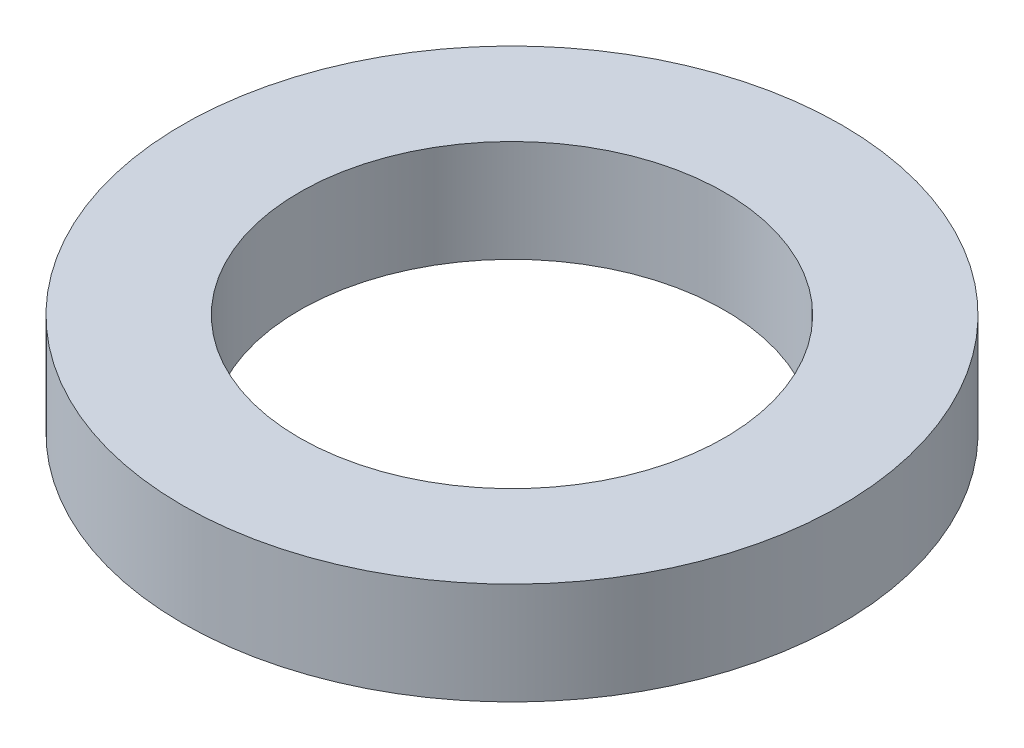
ISO-10303-21;
HEADER;
FILE_DESCRIPTION(('STEP AP214'),'2;1');
FILE_NAME('part.step','',(''),(''),'','','');
FILE_SCHEMA(('AUTOMOTIVE_DESIGN { 1 0 10303 214 1 1 1 1 }'));
ENDSEC;
DATA;
#1=APPLICATION_CONTEXT('core data for automotive mechanical design processes');
#2=APPLICATION_PROTOCOL_DEFINITION('international standard','automotive_design',2000,#1);
#3=PRODUCT_CONTEXT('',#1,'mechanical');
#4=PRODUCT('Part','Part','',(#3));
#5=PRODUCT_RELATED_PRODUCT_CATEGORY('part','',(#4));
#6=PRODUCT_DEFINITION_FORMATION('','',#4);
#7=PRODUCT_DEFINITION_CONTEXT('part definition',#1,'design');
#8=PRODUCT_DEFINITION('design','',#6,#7);
#9=PRODUCT_DEFINITION_SHAPE('','',#8);
#10=(LENGTH_UNIT() NAMED_UNIT(*) SI_UNIT(.MILLI.,.METRE.));
#11=(NAMED_UNIT(*) PLANE_ANGLE_UNIT() SI_UNIT($,.RADIAN.));
#12=(NAMED_UNIT(*) SI_UNIT($,.STERADIAN.) SOLID_ANGLE_UNIT());
#13=UNCERTAINTY_MEASURE_WITH_UNIT(LENGTH_MEASURE(1.E-05),#10,'distance_accuracy_value','');
#14=(GEOMETRIC_REPRESENTATION_CONTEXT(3) GLOBAL_UNCERTAINTY_ASSIGNED_CONTEXT((#13)) GLOBAL_UNIT_ASSIGNED_CONTEXT((#10,
#11,#12)) REPRESENTATION_CONTEXT('',''));
#15=CARTESIAN_POINT('',(0.,0.,0.));
#16=DIRECTION('',(0.,0.,1.));
#17=DIRECTION('',(1.,0.,0.));
#18=AXIS2_PLACEMENT_3D('',#15,#16,#17);
#19=CARTESIAN_POINT('',(0.,24.,0.));
#20=DIRECTION('',(0.,-1.,0.));
#21=DIRECTION('',(0.,0.,-1.));
#22=AXIS2_PLACEMENT_3D('',#19,#20,#21);
#23=CYLINDRICAL_SURFACE('',#22,77.5);
#24=CARTESIAN_POINT('',(0.,24.,0.));
#25=DIRECTION('',(0.,1.,0.));
#26=DIRECTION('',(0.,0.,1.));
#27=AXIS2_PLACEMENT_3D('',#24,#25,#26);
#28=CIRCLE('',#27,77.5);
#29=CARTESIAN_POINT('',(0.,24.,77.5));
#30=VERTEX_POINT('',#29);
#31=EDGE_CURVE('E10',#30,#30,#28,.T.);
#32=ORIENTED_EDGE('',*,*,#31,.F.);
#33=EDGE_LOOP('',(#32));
#34=FACE_BOUND('',#33,.T.);
#35=CARTESIAN_POINT('',(0.,0.,0.));
#36=DIRECTION('',(0.,1.,0.));
#37=DIRECTION('',(0.,0.,1.));
#38=AXIS2_PLACEMENT_3D('',#35,#36,#37);
#39=CIRCLE('',#38,77.5);
#40=CARTESIAN_POINT('',(0.,0.,77.5));
#41=VERTEX_POINT('',#40);
#42=EDGE_CURVE('E37',#41,#41,#39,.T.);
#43=ORIENTED_EDGE('',*,*,#42,.T.);
#44=EDGE_LOOP('',(#43));
#45=FACE_BOUND('',#44,.T.);
#46=ADVANCED_FACE('F40',(#34,#45),#23,.T.);
#47=CARTESIAN_POINT('',(0.,24.,0.));
#48=DIRECTION('',(0.,1.,0.));
#49=DIRECTION('',(0.,0.,1.));
#50=AXIS2_PLACEMENT_3D('',#47,#48,#49);
#51=PLANE('',#50);
#52=CARTESIAN_POINT('',(0.,24.,0.));
#53=DIRECTION('',(0.,1.,0.));
#54=DIRECTION('',(0.,0.,1.));
#55=AXIS2_PLACEMENT_3D('',#52,#53,#54);
#56=CIRCLE('',#55,50.);
#57=CARTESIAN_POINT('',(0.,24.,50.));
#58=VERTEX_POINT('',#57);
#59=EDGE_CURVE('E50',#58,#58,#56,.T.);
#60=ORIENTED_EDGE('',*,*,#59,.F.);
#61=EDGE_LOOP('',(#60));
#62=FACE_BOUND('',#61,.T.);
#63=ORIENTED_EDGE('',*,*,#31,.T.);
#64=EDGE_LOOP('',(#63));
#65=FACE_BOUND('',#64,.T.);
#66=ADVANCED_FACE('F59',(#62,#65),#51,.T.);
#67=CARTESIAN_POINT('',(0.,0.,0.));
#68=DIRECTION('',(0.,1.,0.));
#69=DIRECTION('',(0.,0.,1.));
#70=AXIS2_PLACEMENT_3D('',#67,#68,#69);
#71=PLANE('',#70);
#72=CARTESIAN_POINT('',(0.,0.,0.));
#73=DIRECTION('',(0.,1.,0.));
#74=DIRECTION('',(0.,0.,1.));
#75=AXIS2_PLACEMENT_3D('',#72,#73,#74);
#76=CIRCLE('',#75,50.);
#77=CARTESIAN_POINT('',(0.,0.,50.));
#78=VERTEX_POINT('',#77);
#79=EDGE_CURVE('E47',#78,#78,#76,.T.);
#80=ORIENTED_EDGE('',*,*,#79,.T.);
#81=EDGE_LOOP('',(#80));
#82=FACE_BOUND('',#81,.T.);
#83=ORIENTED_EDGE('',*,*,#42,.F.);
#84=EDGE_LOOP('',(#83));
#85=FACE_BOUND('',#84,.T.);
#86=ADVANCED_FACE('F58',(#82,#85),#71,.F.);
#87=CARTESIAN_POINT('',(0.,24.,0.));
#88=DIRECTION('',(0.,-1.,0.));
#89=DIRECTION('',(0.,0.,-1.));
#90=AXIS2_PLACEMENT_3D('',#87,#88,#89);
#91=CYLINDRICAL_SURFACE('',#90,50.);
#92=ORIENTED_EDGE('',*,*,#59,.T.);
#93=EDGE_LOOP('',(#92));
#94=FACE_BOUND('',#93,.T.);
#95=ORIENTED_EDGE('',*,*,#79,.F.);
#96=EDGE_LOOP('',(#95));
#97=FACE_BOUND('',#96,.T.);
#98=ADVANCED_FACE('F54',(#94,#97),#91,.F.);
#99=CLOSED_SHELL('',(#46,#66,#86,#98));
#100=MANIFOLD_SOLID_BREP('B2',#99);
#101=ADVANCED_BREP_SHAPE_REPRESENTATION('',(#18,#100),#14);
#102=SHAPE_DEFINITION_REPRESENTATION(#9,#101);
ENDSEC;
END-ISO-10303-21;
